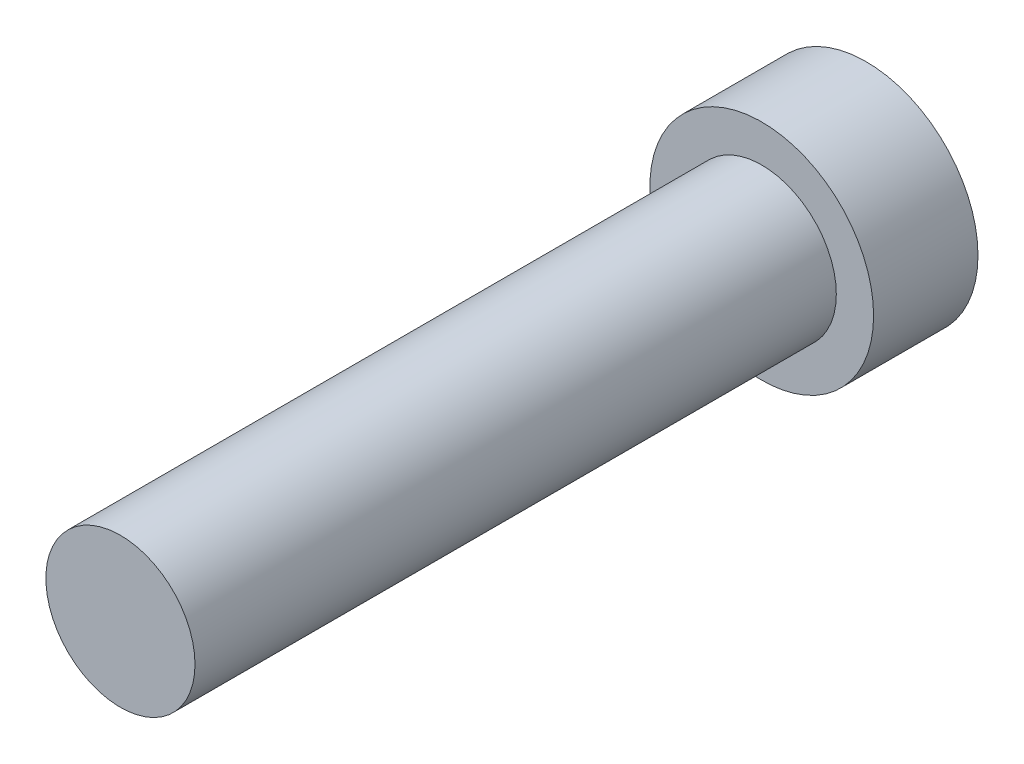
ISO-10303-21;
HEADER;
FILE_DESCRIPTION(('STEP AP214'),'2;1');
FILE_NAME('part.step','',(''),(''),'','','');
FILE_SCHEMA(('AUTOMOTIVE_DESIGN { 1 0 10303 214 1 1 1 1 }'));
ENDSEC;
DATA;
#1=APPLICATION_CONTEXT('core data for automotive mechanical design processes');
#2=APPLICATION_PROTOCOL_DEFINITION('international standard','automotive_design',2000,#1);
#3=PRODUCT_CONTEXT('',#1,'mechanical');
#4=PRODUCT('Part','Part','',(#3));
#5=PRODUCT_RELATED_PRODUCT_CATEGORY('part','',(#4));
#6=PRODUCT_DEFINITION_FORMATION('','',#4);
#7=PRODUCT_DEFINITION_CONTEXT('part definition',#1,'design');
#8=PRODUCT_DEFINITION('design','',#6,#7);
#9=PRODUCT_DEFINITION_SHAPE('','',#8);
#10=(LENGTH_UNIT() NAMED_UNIT(*) SI_UNIT(.MILLI.,.METRE.));
#11=(NAMED_UNIT(*) PLANE_ANGLE_UNIT() SI_UNIT($,.RADIAN.));
#12=(NAMED_UNIT(*) SI_UNIT($,.STERADIAN.) SOLID_ANGLE_UNIT());
#13=UNCERTAINTY_MEASURE_WITH_UNIT(LENGTH_MEASURE(1.E-05),#10,'distance_accuracy_value','');
#14=(GEOMETRIC_REPRESENTATION_CONTEXT(3) GLOBAL_UNCERTAINTY_ASSIGNED_CONTEXT((#13)) GLOBAL_UNIT_ASSIGNED_CONTEXT((#10,
#11,#12)) REPRESENTATION_CONTEXT('',''));
#15=CARTESIAN_POINT('',(0.,0.,0.));
#16=DIRECTION('',(0.,0.,1.));
#17=DIRECTION('',(1.,0.,0.));
#18=AXIS2_PLACEMENT_3D('',#15,#16,#17);
#19=CARTESIAN_POINT('',(0.,0.,7.));
#20=DIRECTION('',(0.,0.,-1.));
#21=DIRECTION('',(-1.,0.,0.));
#22=AXIS2_PLACEMENT_3D('',#19,#20,#21);
#23=CYLINDRICAL_SURFACE('',#22,7.5);
#24=CARTESIAN_POINT('',(0.,0.,7.));
#25=DIRECTION('',(0.,0.,1.));
#26=DIRECTION('',(1.,0.,0.));
#27=AXIS2_PLACEMENT_3D('',#24,#25,#26);
#28=CIRCLE('',#27,7.5);
#29=CARTESIAN_POINT('',(7.5,0.,7.));
#30=VERTEX_POINT('',#29);
#31=EDGE_CURVE('E49',#30,#30,#28,.T.);
#32=ORIENTED_EDGE('',*,*,#31,.F.);
#33=EDGE_LOOP('',(#32));
#34=FACE_BOUND('',#33,.T.);
#35=CARTESIAN_POINT('',(0.,0.,0.));
#36=DIRECTION('',(0.,0.,1.));
#37=DIRECTION('',(1.,0.,0.));
#38=AXIS2_PLACEMENT_3D('',#35,#36,#37);
#39=CIRCLE('',#38,7.5);
#40=CARTESIAN_POINT('',(7.5,0.,0.));
#41=VERTEX_POINT('',#40);
#42=EDGE_CURVE('E44',#41,#41,#39,.T.);
#43=ORIENTED_EDGE('',*,*,#42,.T.);
#44=EDGE_LOOP('',(#43));
#45=FACE_BOUND('',#44,.T.);
#46=ADVANCED_FACE('F41',(#34,#45),#23,.T.);
#47=CARTESIAN_POINT('',(0.,0.,7.));
#48=DIRECTION('',(0.,0.,1.));
#49=DIRECTION('',(1.,0.,0.));
#50=AXIS2_PLACEMENT_3D('',#47,#48,#49);
#51=PLANE('',#50);
#52=CARTESIAN_POINT('',(0.,0.,7.));
#53=DIRECTION('',(0.,0.,1.));
#54=DIRECTION('',(1.,0.,0.));
#55=AXIS2_PLACEMENT_3D('',#52,#53,#54);
#56=CIRCLE('',#55,5.);
#57=CARTESIAN_POINT('',(5.,0.,7.));
#58=VERTEX_POINT('',#57);
#59=EDGE_CURVE('E10',#58,#58,#56,.T.);
#60=ORIENTED_EDGE('',*,*,#59,.F.);
#61=EDGE_LOOP('',(#60));
#62=FACE_BOUND('',#61,.T.);
#63=ORIENTED_EDGE('',*,*,#31,.T.);
#64=EDGE_LOOP('',(#63));
#65=FACE_BOUND('',#64,.T.);
#66=ADVANCED_FACE('F69',(#62,#65),#51,.T.);
#67=CARTESIAN_POINT('',(0.,0.,0.));
#68=DIRECTION('',(0.,0.,1.));
#69=DIRECTION('',(1.,0.,0.));
#70=AXIS2_PLACEMENT_3D('',#67,#68,#69);
#71=PLANE('',#70);
#72=ORIENTED_EDGE('',*,*,#42,.F.);
#73=EDGE_LOOP('',(#72));
#74=FACE_BOUND('',#73,.T.);
#75=ADVANCED_FACE('F66',(#74),#71,.F.);
#76=CARTESIAN_POINT('',(0.,0.,50.));
#77=DIRECTION('',(0.,0.,-1.));
#78=DIRECTION('',(-1.,0.,0.));
#79=AXIS2_PLACEMENT_3D('',#76,#77,#78);
#80=CYLINDRICAL_SURFACE('',#79,5.);
#81=CARTESIAN_POINT('',(0.,0.,50.));
#82=DIRECTION('',(0.,0.,1.));
#83=DIRECTION('',(1.,0.,0.));
#84=AXIS2_PLACEMENT_3D('',#81,#82,#83);
#85=CIRCLE('',#84,5.);
#86=CARTESIAN_POINT('',(5.,0.,50.));
#87=VERTEX_POINT('',#86);
#88=EDGE_CURVE('E57',#87,#87,#85,.T.);
#89=ORIENTED_EDGE('',*,*,#88,.F.);
#90=EDGE_LOOP('',(#89));
#91=FACE_BOUND('',#90,.T.);
#92=ORIENTED_EDGE('',*,*,#59,.T.);
#93=EDGE_LOOP('',(#92));
#94=FACE_BOUND('',#93,.T.);
#95=ADVANCED_FACE('F68',(#91,#94),#80,.T.);
#96=CARTESIAN_POINT('',(0.,0.,50.));
#97=DIRECTION('',(0.,0.,1.));
#98=DIRECTION('',(1.,0.,0.));
#99=AXIS2_PLACEMENT_3D('',#96,#97,#98);
#100=PLANE('',#99);
#101=ORIENTED_EDGE('',*,*,#88,.T.);
#102=EDGE_LOOP('',(#101));
#103=FACE_BOUND('',#102,.T.);
#104=ADVANCED_FACE('F73',(#103),#100,.T.);
#105=CLOSED_SHELL('',(#46,#66,#75,#95,#104));
#106=MANIFOLD_SOLID_BREP('B2',#105);
#107=ADVANCED_BREP_SHAPE_REPRESENTATION('',(#18,#106),#14);
#108=SHAPE_DEFINITION_REPRESENTATION(#9,#107);
ENDSEC;
END-ISO-10303-21;
